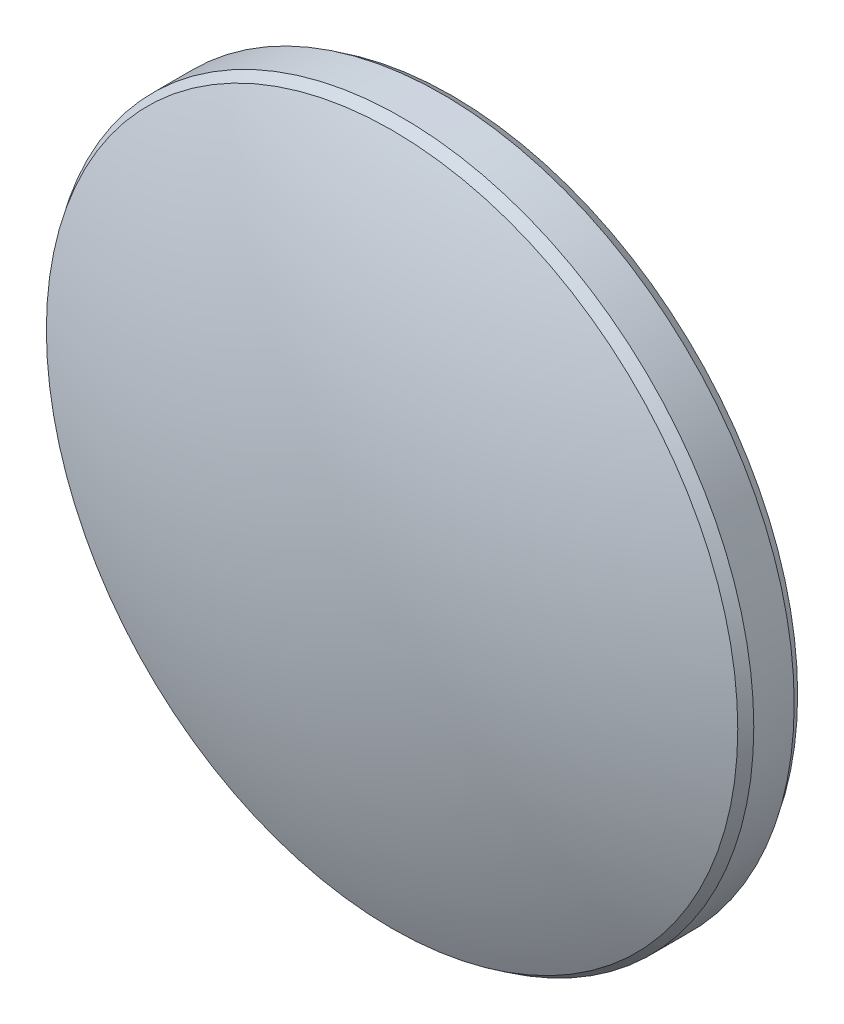
ISO-10303-21;
HEADER;
FILE_DESCRIPTION(('STEP AP214'),'2;1');
FILE_NAME('part.step','',(''),(''),'','','');
FILE_SCHEMA(('AUTOMOTIVE_DESIGN { 1 0 10303 214 1 1 1 1 }'));
ENDSEC;
DATA;
#1=APPLICATION_CONTEXT('core data for automotive mechanical design processes');
#2=APPLICATION_PROTOCOL_DEFINITION('international standard','automotive_design',2000,#1);
#3=PRODUCT_CONTEXT('',#1,'mechanical');
#4=PRODUCT('Part','Part','',(#3));
#5=PRODUCT_RELATED_PRODUCT_CATEGORY('part','',(#4));
#6=PRODUCT_DEFINITION_FORMATION('','',#4);
#7=PRODUCT_DEFINITION_CONTEXT('part definition',#1,'design');
#8=PRODUCT_DEFINITION('design','',#6,#7);
#9=PRODUCT_DEFINITION_SHAPE('','',#8);
#10=(LENGTH_UNIT() NAMED_UNIT(*) SI_UNIT(.MILLI.,.METRE.));
#11=(NAMED_UNIT(*) PLANE_ANGLE_UNIT() SI_UNIT($,.RADIAN.));
#12=(NAMED_UNIT(*) SI_UNIT($,.STERADIAN.) SOLID_ANGLE_UNIT());
#13=UNCERTAINTY_MEASURE_WITH_UNIT(LENGTH_MEASURE(1.E-05),#10,'distance_accuracy_value','');
#14=(GEOMETRIC_REPRESENTATION_CONTEXT(3) GLOBAL_UNCERTAINTY_ASSIGNED_CONTEXT((#13)) GLOBAL_UNIT_ASSIGNED_CONTEXT((#10,
#11,#12)) REPRESENTATION_CONTEXT('',''));
#15=CARTESIAN_POINT('',(0.,0.,0.));
#16=DIRECTION('',(0.,0.,1.));
#17=DIRECTION('',(1.,0.,0.));
#18=AXIS2_PLACEMENT_3D('',#15,#16,#17);
#19=CARTESIAN_POINT('',(0.,0.,-27.3));
#20=DIRECTION('',(0.,0.,1.));
#21=DIRECTION('',(0.,1.,0.));
#22=AXIS2_PLACEMENT_3D('',#19,#20,#21);
#23=SPHERICAL_SURFACE('',#22,31.);
#24=CARTESIAN_POINT('',(0.,0.,1.08002493441896));
#25=DIRECTION('',(0.,0.,-1.));
#26=DIRECTION('',(-1.,0.,0.));
#27=AXIS2_PLACEMENT_3D('',#24,#25,#26);
#28=CIRCLE('',#27,12.4729380950022);
#29=CARTESIAN_POINT('',(-12.4729380950022,0.,1.08002493441896));
#30=VERTEX_POINT('',#29);
#31=EDGE_CURVE('E9',#30,#30,#28,.F.);
#32=ORIENTED_EDGE('',*,*,#31,.T.);
#33=EDGE_LOOP('',(#32));
#34=FACE_BOUND('',#33,.T.);
#35=ADVANCED_FACE('F13',(#34),#23,.T.);
#36=CARTESIAN_POINT('',(0.,0.,3.7));
#37=DIRECTION('',(0.,0.,1.));
#38=DIRECTION('',(1.,0.,0.));
#39=AXIS2_PLACEMENT_3D('',#36,#37,#38);
#40=CYLINDRICAL_SURFACE('',#39,12.7);
#41=CARTESIAN_POINT('',(0.,0.,-0.729144258622819));
#42=DIRECTION('',(0.,0.,1.));
#43=DIRECTION('',(1.,0.,0.));
#44=AXIS2_PLACEMENT_3D('',#41,#42,#43);
#45=CIRCLE('',#44,12.7);
#46=CARTESIAN_POINT('',(12.7,0.,-0.729144258622819));
#47=VERTEX_POINT('',#46);
#48=EDGE_CURVE('E24',#47,#47,#45,.T.);
#49=ORIENTED_EDGE('',*,*,#48,.T.);
#50=EDGE_LOOP('',(#49));
#51=FACE_BOUND('',#50,.T.);
#52=CARTESIAN_POINT('',(0.,0.,0.729144258622826));
#53=DIRECTION('',(0.,0.,-1.));
#54=DIRECTION('',(-1.,0.,0.));
#55=AXIS2_PLACEMENT_3D('',#52,#53,#54);
#56=CIRCLE('',#55,12.7);
#57=CARTESIAN_POINT('',(-12.7,0.,0.729144258622826));
#58=VERTEX_POINT('',#57);
#59=EDGE_CURVE('E28',#58,#58,#56,.T.);
#60=ORIENTED_EDGE('',*,*,#59,.T.);
#61=EDGE_LOOP('',(#60));
#62=FACE_BOUND('',#61,.T.);
#63=ADVANCED_FACE('F34',(#51,#62),#40,.T.);
#64=CARTESIAN_POINT('',(0.,0.,27.3));
#65=DIRECTION('',(0.,0.,1.));
#66=DIRECTION('',(0.,1.,0.));
#67=AXIS2_PLACEMENT_3D('',#64,#65,#66);
#68=SPHERICAL_SURFACE('',#67,31.);
#69=CARTESIAN_POINT('',(0.,0.,-1.08002493441896));
#70=DIRECTION('',(0.,0.,1.));
#71=DIRECTION('',(1.,0.,0.));
#72=AXIS2_PLACEMENT_3D('',#69,#70,#71);
#73=CIRCLE('',#72,12.4729380950022);
#74=CARTESIAN_POINT('',(12.4729380950022,0.,-1.08002493441896));
#75=VERTEX_POINT('',#74);
#76=EDGE_CURVE('E20',#75,#75,#73,.F.);
#77=ORIENTED_EDGE('',*,*,#76,.T.);
#78=EDGE_LOOP('',(#77));
#79=FACE_BOUND('',#78,.T.);
#80=ADVANCED_FACE('F43',(#79),#68,.T.);
#81=CARTESIAN_POINT('',(0.,0.,-0.729144258622819));
#82=DIRECTION('',(0.,0.,1.));
#83=DIRECTION('',(1.,0.,0.));
#84=AXIS2_PLACEMENT_3D('',#81,#82,#83);
#85=CONICAL_SURFACE('',#84,12.7,0.574347955094062);
#86=ORIENTED_EDGE('',*,*,#76,.F.);
#87=EDGE_LOOP('',(#86));
#88=FACE_BOUND('',#87,.T.);
#89=ORIENTED_EDGE('',*,*,#48,.F.);
#90=EDGE_LOOP('',(#89));
#91=FACE_BOUND('',#90,.T.);
#92=ADVANCED_FACE('F38',(#88,#91),#85,.T.);
#93=CARTESIAN_POINT('',(0.,0.,1.08002493441896));
#94=DIRECTION('',(0.,0.,-1.));
#95=DIRECTION('',(-1.,0.,0.));
#96=AXIS2_PLACEMENT_3D('',#93,#94,#95);
#97=CONICAL_SURFACE('',#96,12.4729380950022,0.574347955094061);
#98=ORIENTED_EDGE('',*,*,#59,.F.);
#99=EDGE_LOOP('',(#98));
#100=FACE_BOUND('',#99,.T.);
#101=ORIENTED_EDGE('',*,*,#31,.F.);
#102=EDGE_LOOP('',(#101));
#103=FACE_BOUND('',#102,.T.);
#104=ADVANCED_FACE('F15',(#100,#103),#97,.T.);
#105=CLOSED_SHELL('',(#35,#63,#80,#92,#104));
#106=MANIFOLD_SOLID_BREP('B1',#105);
#107=ADVANCED_BREP_SHAPE_REPRESENTATION('',(#18,#106),#14);
#108=SHAPE_DEFINITION_REPRESENTATION(#9,#107);
ENDSEC;
END-ISO-10303-21;
